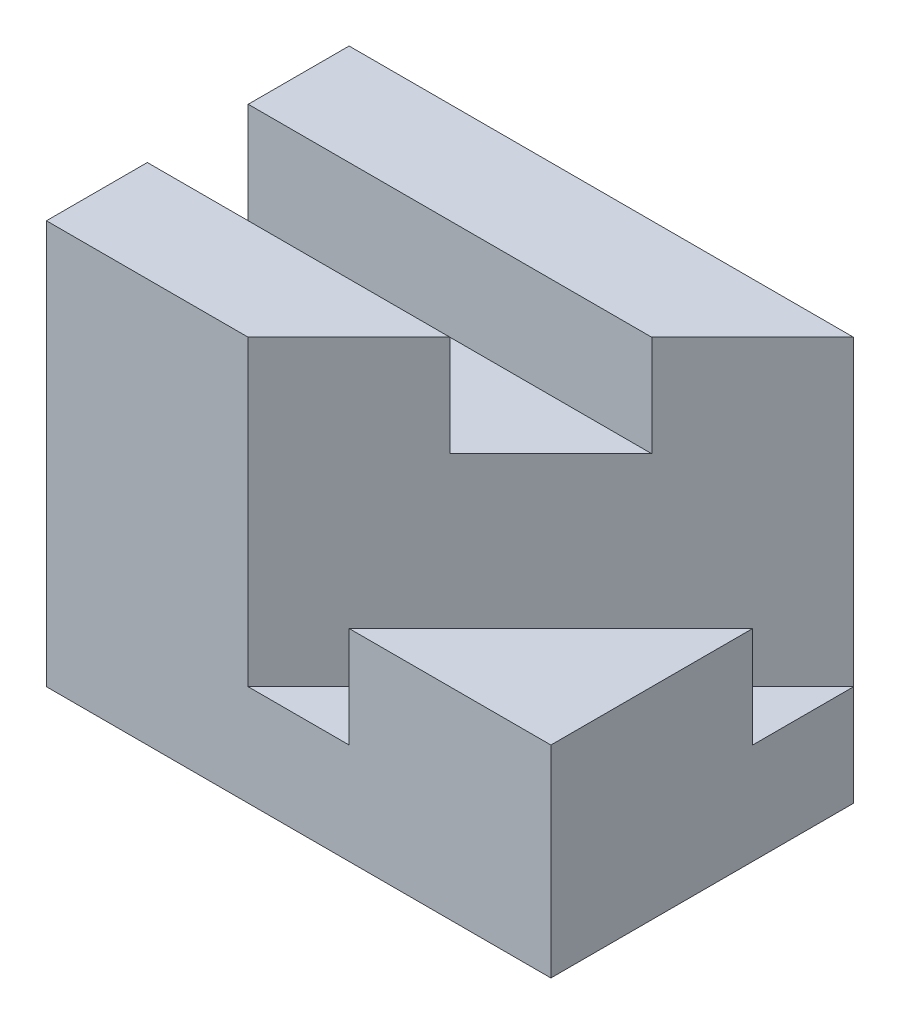
ISO-10303-21;
HEADER;
FILE_DESCRIPTION(('STEP AP214'),'2;1');
FILE_NAME('part.step','',(''),(''),'','','');
FILE_SCHEMA(('AUTOMOTIVE_DESIGN { 1 0 10303 214 1 1 1 1 }'));
ENDSEC;
DATA;
#1=APPLICATION_CONTEXT('core data for automotive mechanical design processes');
#2=APPLICATION_PROTOCOL_DEFINITION('international standard','automotive_design',2000,#1);
#3=PRODUCT_CONTEXT('',#1,'mechanical');
#4=PRODUCT('Part','Part','',(#3));
#5=PRODUCT_RELATED_PRODUCT_CATEGORY('part','',(#4));
#6=PRODUCT_DEFINITION_FORMATION('','',#4);
#7=PRODUCT_DEFINITION_CONTEXT('part definition',#1,'design');
#8=PRODUCT_DEFINITION('design','',#6,#7);
#9=PRODUCT_DEFINITION_SHAPE('','',#8);
#10=(LENGTH_UNIT() NAMED_UNIT(*) SI_UNIT(.MILLI.,.METRE.));
#11=(NAMED_UNIT(*) PLANE_ANGLE_UNIT() SI_UNIT($,.RADIAN.));
#12=(NAMED_UNIT(*) SI_UNIT($,.STERADIAN.) SOLID_ANGLE_UNIT());
#13=UNCERTAINTY_MEASURE_WITH_UNIT(LENGTH_MEASURE(1.E-05),#10,'distance_accuracy_value','');
#14=(GEOMETRIC_REPRESENTATION_CONTEXT(3) GLOBAL_UNCERTAINTY_ASSIGNED_CONTEXT((#13)) GLOBAL_UNIT_ASSIGNED_CONTEXT((#10,
#11,#12)) REPRESENTATION_CONTEXT('',''));
#15=CARTESIAN_POINT('',(0.,0.,0.));
#16=DIRECTION('',(0.,0.,1.));
#17=DIRECTION('',(1.,0.,0.));
#18=AXIS2_PLACEMENT_3D('',#15,#16,#17);
#19=CARTESIAN_POINT('',(50.,10.,0.));
#20=DIRECTION('',(1.,0.,0.));
#21=DIRECTION('',(0.,0.,-1.));
#22=AXIS2_PLACEMENT_3D('',#19,#20,#21);
#23=PLANE('',#22);
#24=DIRECTION('',(0.,0.,1.));
#25=VECTOR('',#24,1.);
#26=CARTESIAN_POINT('',(50.,0.,0.));
#27=LINE('',#26,#25);
#28=CARTESIAN_POINT('',(50.,0.,-30.));
#29=VERTEX_POINT('',#28);
#30=CARTESIAN_POINT('',(50.,0.,0.));
#31=VERTEX_POINT('',#30);
#32=EDGE_CURVE('E203',#29,#31,#27,.T.);
#33=ORIENTED_EDGE('',*,*,#32,.F.);
#34=DIRECTION('',(0.,-1.,0.));
#35=VECTOR('',#34,1.);
#36=CARTESIAN_POINT('',(50.,10.,-30.));
#37=LINE('',#36,#35);
#38=CARTESIAN_POINT('',(50.,10.,-30.));
#39=VERTEX_POINT('',#38);
#40=EDGE_CURVE('E11',#39,#29,#37,.T.);
#41=ORIENTED_EDGE('',*,*,#40,.F.);
#42=DIRECTION('',(0.,0.,1.));
#43=VECTOR('',#42,1.);
#44=CARTESIAN_POINT('',(50.,10.,0.));
#45=LINE('',#44,#43);
#46=CARTESIAN_POINT('',(50.,10.,-20.));
#47=VERTEX_POINT('',#46);
#48=EDGE_CURVE('E206',#39,#47,#45,.T.);
#49=ORIENTED_EDGE('',*,*,#48,.T.);
#50=DIRECTION('',(0.,-1.,0.));
#51=VECTOR('',#50,1.);
#52=CARTESIAN_POINT('',(50.,20.,-20.));
#53=LINE('',#52,#51);
#54=CARTESIAN_POINT('',(50.,20.,-20.));
#55=VERTEX_POINT('',#54);
#56=EDGE_CURVE('E201',#55,#47,#53,.T.);
#57=ORIENTED_EDGE('',*,*,#56,.F.);
#58=DIRECTION('',(0.,0.,1.));
#59=VECTOR('',#58,1.);
#60=CARTESIAN_POINT('',(50.,20.,0.));
#61=LINE('',#60,#59);
#62=CARTESIAN_POINT('',(50.,20.,0.));
#63=VERTEX_POINT('',#62);
#64=EDGE_CURVE('E186',#55,#63,#61,.T.);
#65=ORIENTED_EDGE('',*,*,#64,.T.);
#66=DIRECTION('',(0.,-1.,0.));
#67=VECTOR('',#66,1.);
#68=CARTESIAN_POINT('',(50.,20.,0.));
#69=LINE('',#68,#67);
#70=EDGE_CURVE('E195',#63,#31,#69,.T.);
#71=ORIENTED_EDGE('',*,*,#70,.T.);
#72=EDGE_LOOP('',(#33,#41,#49,#57,#65,#71));
#73=FACE_BOUND('',#72,.T.);
#74=ADVANCED_FACE('F33',(#73),#23,.T.);
#75=CARTESIAN_POINT('',(0.,10.,0.));
#76=DIRECTION('',(0.,0.,1.));
#77=DIRECTION('',(1.,0.,0.));
#78=AXIS2_PLACEMENT_3D('',#75,#76,#77);
#79=PLANE('',#78);
#80=DIRECTION('',(-1.,0.,0.));
#81=VECTOR('',#80,1.);
#82=CARTESIAN_POINT('',(0.,0.,0.));
#83=LINE('',#82,#81);
#84=CARTESIAN_POINT('',(0.,0.,0.));
#85=VERTEX_POINT('',#84);
#86=EDGE_CURVE('E207',#31,#85,#83,.T.);
#87=ORIENTED_EDGE('',*,*,#86,.F.);
#88=ORIENTED_EDGE('',*,*,#70,.F.);
#89=DIRECTION('',(-1.,0.,0.));
#90=VECTOR('',#89,1.);
#91=CARTESIAN_POINT('',(0.,20.,0.));
#92=LINE('',#91,#90);
#93=CARTESIAN_POINT('',(30.,20.,0.));
#94=VERTEX_POINT('',#93);
#95=EDGE_CURVE('E192',#63,#94,#92,.T.);
#96=ORIENTED_EDGE('',*,*,#95,.T.);
#97=DIRECTION('',(0.,-1.,0.));
#98=VECTOR('',#97,1.);
#99=CARTESIAN_POINT('',(30.,20.,0.));
#100=LINE('',#99,#98);
#101=CARTESIAN_POINT('',(30.,10.,0.));
#102=VERTEX_POINT('',#101);
#103=EDGE_CURVE('E198',#94,#102,#100,.T.);
#104=ORIENTED_EDGE('',*,*,#103,.T.);
#105=DIRECTION('',(-1.,0.,0.));
#106=VECTOR('',#105,1.);
#107=CARTESIAN_POINT('',(0.,10.,0.));
#108=LINE('',#107,#106);
#109=CARTESIAN_POINT('',(20.,10.,0.));
#110=VERTEX_POINT('',#109);
#111=EDGE_CURVE('E41',#102,#110,#108,.T.);
#112=ORIENTED_EDGE('',*,*,#111,.T.);
#113=DIRECTION('',(0.,-1.,0.));
#114=VECTOR('',#113,1.);
#115=CARTESIAN_POINT('',(20.,40.,0.));
#116=LINE('',#115,#114);
#117=CARTESIAN_POINT('',(20.,40.,0.));
#118=VERTEX_POINT('',#117);
#119=EDGE_CURVE('E168',#118,#110,#116,.T.);
#120=ORIENTED_EDGE('',*,*,#119,.F.);
#121=DIRECTION('',(-1.,0.,0.));
#122=VECTOR('',#121,1.);
#123=CARTESIAN_POINT('',(0.,40.,0.));
#124=LINE('',#123,#122);
#125=CARTESIAN_POINT('',(0.,40.,0.));
#126=VERTEX_POINT('',#125);
#127=EDGE_CURVE('E160',#118,#126,#124,.T.);
#128=ORIENTED_EDGE('',*,*,#127,.T.);
#129=DIRECTION('',(0.,-1.,0.));
#130=VECTOR('',#129,1.);
#131=CARTESIAN_POINT('',(0.,40.,0.));
#132=LINE('',#131,#130);
#133=EDGE_CURVE('E171',#126,#85,#132,.T.);
#134=ORIENTED_EDGE('',*,*,#133,.T.);
#135=EDGE_LOOP('',(#87,#88,#96,#104,#112,#120,#128,#134));
#136=FACE_BOUND('',#135,.T.);
#137=ADVANCED_FACE('F219',(#136),#79,.T.);
#138=CARTESIAN_POINT('',(0.,10.,0.));
#139=DIRECTION('',(0.,1.,0.));
#140=DIRECTION('',(0.,0.,1.));
#141=AXIS2_PLACEMENT_3D('',#138,#139,#140);
#142=PLANE('',#141);
#143=DIRECTION('',(-0.707106781186548,0.,0.707106781186548));
#144=VECTOR('',#143,1.);
#145=CARTESIAN_POINT('',(15.,10.,15.));
#146=LINE('',#145,#144);
#147=EDGE_CURVE('E204',#47,#102,#146,.T.);
#148=ORIENTED_EDGE('',*,*,#147,.F.);
#149=ORIENTED_EDGE('',*,*,#48,.F.);
#150=DIRECTION('',(-0.707106781186547,0.,0.707106781186548));
#151=VECTOR('',#150,1.);
#152=CARTESIAN_POINT('',(10.,10.,10.));
#153=LINE('',#152,#151);
#154=EDGE_CURVE('E209',#39,#110,#153,.T.);
#155=ORIENTED_EDGE('',*,*,#154,.T.);
#156=ORIENTED_EDGE('',*,*,#111,.F.);
#157=EDGE_LOOP('',(#148,#149,#155,#156));
#158=FACE_BOUND('',#157,.T.);
#159=ADVANCED_FACE('F246',(#158),#142,.T.);
#160=CARTESIAN_POINT('',(0.,0.,0.));
#161=DIRECTION('',(0.,1.,0.));
#162=DIRECTION('',(0.,0.,1.));
#163=AXIS2_PLACEMENT_3D('',#160,#161,#162);
#164=PLANE('',#163);
#165=ORIENTED_EDGE('',*,*,#86,.T.);
#166=DIRECTION('',(0.,0.,-1.));
#167=VECTOR('',#166,1.);
#168=CARTESIAN_POINT('',(0.,0.,0.));
#169=LINE('',#168,#167);
#170=CARTESIAN_POINT('',(0.,0.,-30.));
#171=VERTEX_POINT('',#170);
#172=EDGE_CURVE('E176',#85,#171,#169,.T.);
#173=ORIENTED_EDGE('',*,*,#172,.T.);
#174=DIRECTION('',(1.,0.,0.));
#175=VECTOR('',#174,1.);
#176=CARTESIAN_POINT('',(0.,0.,-30.));
#177=LINE('',#176,#175);
#178=EDGE_CURVE('E142',#171,#29,#177,.T.);
#179=ORIENTED_EDGE('',*,*,#178,.T.);
#180=ORIENTED_EDGE('',*,*,#32,.T.);
#181=EDGE_LOOP('',(#165,#173,#179,#180));
#182=FACE_BOUND('',#181,.T.);
#183=ADVANCED_FACE('F215',(#182),#164,.F.);
#184=CARTESIAN_POINT('',(15.,20.,15.));
#185=DIRECTION('',(0.707106781186548,0.,0.707106781186548));
#186=DIRECTION('',(0.707106781186548,0.,-0.707106781186548));
#187=AXIS2_PLACEMENT_3D('',#184,#185,#186);
#188=PLANE('',#187);
#189=ORIENTED_EDGE('',*,*,#147,.T.);
#190=ORIENTED_EDGE('',*,*,#103,.F.);
#191=DIRECTION('',(-0.707106781186548,0.,0.707106781186548));
#192=VECTOR('',#191,1.);
#193=CARTESIAN_POINT('',(15.,20.,15.));
#194=LINE('',#193,#192);
#195=EDGE_CURVE('E190',#55,#94,#194,.T.);
#196=ORIENTED_EDGE('',*,*,#195,.F.);
#197=ORIENTED_EDGE('',*,*,#56,.T.);
#198=EDGE_LOOP('',(#189,#190,#196,#197));
#199=FACE_BOUND('',#198,.T.);
#200=ADVANCED_FACE('F255',(#199),#188,.F.);
#201=CARTESIAN_POINT('',(0.,20.,0.));
#202=DIRECTION('',(0.,1.,0.));
#203=DIRECTION('',(0.,0.,1.));
#204=AXIS2_PLACEMENT_3D('',#201,#202,#203);
#205=PLANE('',#204);
#206=ORIENTED_EDGE('',*,*,#64,.F.);
#207=ORIENTED_EDGE('',*,*,#195,.T.);
#208=ORIENTED_EDGE('',*,*,#95,.F.);
#209=EDGE_LOOP('',(#206,#207,#208));
#210=FACE_BOUND('',#209,.T.);
#211=ADVANCED_FACE('F252',(#210),#205,.T.);
#212=CARTESIAN_POINT('',(0.,30.,0.));
#213=DIRECTION('',(-1.,0.,0.));
#214=DIRECTION('',(0.,0.,1.));
#215=AXIS2_PLACEMENT_3D('',#212,#213,#214);
#216=PLANE('',#215);
#217=ORIENTED_EDGE('',*,*,#172,.F.);
#218=ORIENTED_EDGE('',*,*,#133,.F.);
#219=DIRECTION('',(0.,0.,-1.));
#220=VECTOR('',#219,1.);
#221=CARTESIAN_POINT('',(0.,40.,0.));
#222=LINE('',#221,#220);
#223=CARTESIAN_POINT('',(0.,40.,-9.99999999999999));
#224=VERTEX_POINT('',#223);
#225=EDGE_CURVE('E157',#126,#224,#222,.T.);
#226=ORIENTED_EDGE('',*,*,#225,.T.);
#227=DIRECTION('',(0.,-1.,0.));
#228=VECTOR('',#227,1.);
#229=CARTESIAN_POINT('',(0.,40.,-9.99999999999999));
#230=LINE('',#229,#228);
#231=CARTESIAN_POINT('',(0.,30.,-9.99999999999999));
#232=VERTEX_POINT('',#231);
#233=EDGE_CURVE('E174',#224,#232,#230,.T.);
#234=ORIENTED_EDGE('',*,*,#233,.T.);
#235=DIRECTION('',(0.,0.,-1.));
#236=VECTOR('',#235,1.);
#237=CARTESIAN_POINT('',(0.,30.,0.));
#238=LINE('',#237,#236);
#239=CARTESIAN_POINT('',(0.,30.,-20.));
#240=VERTEX_POINT('',#239);
#241=EDGE_CURVE('E124',#232,#240,#238,.T.);
#242=ORIENTED_EDGE('',*,*,#241,.T.);
#243=DIRECTION('',(0.,-1.,0.));
#244=VECTOR('',#243,1.);
#245=CARTESIAN_POINT('',(0.,40.,-20.));
#246=LINE('',#245,#244);
#247=CARTESIAN_POINT('',(0.,40.,-20.));
#248=VERTEX_POINT('',#247);
#249=EDGE_CURVE('E114',#248,#240,#246,.T.);
#250=ORIENTED_EDGE('',*,*,#249,.F.);
#251=DIRECTION('',(0.,0.,-1.));
#252=VECTOR('',#251,1.);
#253=CARTESIAN_POINT('',(0.,40.,0.));
#254=LINE('',#253,#252);
#255=CARTESIAN_POINT('',(0.,40.,-30.));
#256=VERTEX_POINT('',#255);
#257=EDGE_CURVE('E120',#248,#256,#254,.T.);
#258=ORIENTED_EDGE('',*,*,#257,.T.);
#259=DIRECTION('',(0.,-1.,0.));
#260=VECTOR('',#259,1.);
#261=CARTESIAN_POINT('',(0.,40.,-30.));
#262=LINE('',#261,#260);
#263=EDGE_CURVE('E148',#256,#171,#262,.T.);
#264=ORIENTED_EDGE('',*,*,#263,.T.);
#265=EDGE_LOOP('',(#217,#218,#226,#234,#242,#250,#258,#264));
#266=FACE_BOUND('',#265,.T.);
#267=ADVANCED_FACE('F117',(#266),#216,.T.);
#268=CARTESIAN_POINT('',(10.,30.,10.));
#269=DIRECTION('',(0.707106781186548,0.,0.707106781186547));
#270=DIRECTION('',(0.707106781186547,0.,-0.707106781186548));
#271=AXIS2_PLACEMENT_3D('',#268,#269,#270);
#272=PLANE('',#271);
#273=DIRECTION('',(-0.707106781186547,0.,0.707106781186548));
#274=VECTOR('',#273,1.);
#275=CARTESIAN_POINT('',(10.,30.,10.));
#276=LINE('',#275,#274);
#277=CARTESIAN_POINT('',(40.,30.,-20.));
#278=VERTEX_POINT('',#277);
#279=CARTESIAN_POINT('',(30.,30.,-9.99999999999999));
#280=VERTEX_POINT('',#279);
#281=EDGE_CURVE('E183',#278,#280,#276,.T.);
#282=ORIENTED_EDGE('',*,*,#281,.T.);
#283=DIRECTION('',(0.,-1.,0.));
#284=VECTOR('',#283,1.);
#285=CARTESIAN_POINT('',(30.,40.,-9.99999999999999));
#286=LINE('',#285,#284);
#287=CARTESIAN_POINT('',(30.,40.,-9.99999999999999));
#288=VERTEX_POINT('',#287);
#289=EDGE_CURVE('E166',#288,#280,#286,.T.);
#290=ORIENTED_EDGE('',*,*,#289,.F.);
#291=DIRECTION('',(-0.707106781186547,0.,0.707106781186548));
#292=VECTOR('',#291,1.);
#293=CARTESIAN_POINT('',(10.,40.,10.));
#294=LINE('',#293,#292);
#295=EDGE_CURVE('E163',#288,#118,#294,.T.);
#296=ORIENTED_EDGE('',*,*,#295,.T.);
#297=ORIENTED_EDGE('',*,*,#119,.T.);
#298=ORIENTED_EDGE('',*,*,#154,.F.);
#299=DIRECTION('',(0.,-1.,0.));
#300=VECTOR('',#299,1.);
#301=CARTESIAN_POINT('',(50.,40.,-30.));
#302=LINE('',#301,#300);
#303=CARTESIAN_POINT('',(50.,40.,-30.));
#304=VERTEX_POINT('',#303);
#305=EDGE_CURVE('E151',#304,#39,#302,.T.);
#306=ORIENTED_EDGE('',*,*,#305,.F.);
#307=DIRECTION('',(-0.707106781186547,0.,0.707106781186548));
#308=VECTOR('',#307,1.);
#309=CARTESIAN_POINT('',(10.,40.,10.));
#310=LINE('',#309,#308);
#311=CARTESIAN_POINT('',(40.,40.,-20.));
#312=VERTEX_POINT('',#311);
#313=EDGE_CURVE('E137',#304,#312,#310,.T.);
#314=ORIENTED_EDGE('',*,*,#313,.T.);
#315=DIRECTION('',(0.,-1.,0.));
#316=VECTOR('',#315,1.);
#317=CARTESIAN_POINT('',(40.,40.,-20.));
#318=LINE('',#317,#316);
#319=EDGE_CURVE('E128',#312,#278,#318,.T.);
#320=ORIENTED_EDGE('',*,*,#319,.T.);
#321=EDGE_LOOP('',(#282,#290,#296,#297,#298,#306,#314,#320));
#322=FACE_BOUND('',#321,.T.);
#323=ADVANCED_FACE('F226',(#322),#272,.T.);
#324=CARTESIAN_POINT('',(0.,30.,0.));
#325=DIRECTION('',(0.,1.,0.));
#326=DIRECTION('',(0.,0.,1.));
#327=AXIS2_PLACEMENT_3D('',#324,#325,#326);
#328=PLANE('',#327);
#329=DIRECTION('',(1.,0.,0.));
#330=VECTOR('',#329,1.);
#331=CARTESIAN_POINT('',(0.,30.,-20.));
#332=LINE('',#331,#330);
#333=EDGE_CURVE('E177',#240,#278,#332,.T.);
#334=ORIENTED_EDGE('',*,*,#333,.F.);
#335=ORIENTED_EDGE('',*,*,#241,.F.);
#336=DIRECTION('',(1.,0.,0.));
#337=VECTOR('',#336,1.);
#338=CARTESIAN_POINT('',(0.,30.,-9.99999999999999));
#339=LINE('',#338,#337);
#340=EDGE_CURVE('E180',#232,#280,#339,.T.);
#341=ORIENTED_EDGE('',*,*,#340,.T.);
#342=ORIENTED_EDGE('',*,*,#281,.F.);
#343=EDGE_LOOP('',(#334,#335,#341,#342));
#344=FACE_BOUND('',#343,.T.);
#345=ADVANCED_FACE('F231',(#344),#328,.T.);
#346=CARTESIAN_POINT('',(0.,40.,-9.99999999999999));
#347=DIRECTION('',(0.,0.,-1.));
#348=DIRECTION('',(-1.,0.,0.));
#349=AXIS2_PLACEMENT_3D('',#346,#347,#348);
#350=PLANE('',#349);
#351=ORIENTED_EDGE('',*,*,#289,.T.);
#352=ORIENTED_EDGE('',*,*,#340,.F.);
#353=ORIENTED_EDGE('',*,*,#233,.F.);
#354=DIRECTION('',(1.,0.,0.));
#355=VECTOR('',#354,1.);
#356=CARTESIAN_POINT('',(0.,40.,-9.99999999999999));
#357=LINE('',#356,#355);
#358=EDGE_CURVE('E127',#224,#288,#357,.T.);
#359=ORIENTED_EDGE('',*,*,#358,.T.);
#360=EDGE_LOOP('',(#351,#352,#353,#359));
#361=FACE_BOUND('',#360,.T.);
#362=ADVANCED_FACE('F229',(#361),#350,.T.);
#363=CARTESIAN_POINT('',(0.,40.,0.));
#364=DIRECTION('',(0.,1.,0.));
#365=DIRECTION('',(0.,0.,1.));
#366=AXIS2_PLACEMENT_3D('',#363,#364,#365);
#367=PLANE('',#366);
#368=ORIENTED_EDGE('',*,*,#358,.F.);
#369=ORIENTED_EDGE('',*,*,#225,.F.);
#370=ORIENTED_EDGE('',*,*,#127,.F.);
#371=ORIENTED_EDGE('',*,*,#295,.F.);
#372=EDGE_LOOP('',(#368,#369,#370,#371));
#373=FACE_BOUND('',#372,.T.);
#374=ADVANCED_FACE('F224',(#373),#367,.T.);
#375=CARTESIAN_POINT('',(0.,40.,-20.));
#376=DIRECTION('',(0.,0.,-1.));
#377=DIRECTION('',(-1.,0.,0.));
#378=AXIS2_PLACEMENT_3D('',#375,#376,#377);
#379=PLANE('',#378);
#380=ORIENTED_EDGE('',*,*,#333,.T.);
#381=ORIENTED_EDGE('',*,*,#319,.F.);
#382=DIRECTION('',(1.,0.,0.));
#383=VECTOR('',#382,1.);
#384=CARTESIAN_POINT('',(0.,40.,-20.));
#385=LINE('',#384,#383);
#386=EDGE_CURVE('E131',#248,#312,#385,.T.);
#387=ORIENTED_EDGE('',*,*,#386,.F.);
#388=ORIENTED_EDGE('',*,*,#249,.T.);
#389=EDGE_LOOP('',(#380,#381,#387,#388));
#390=FACE_BOUND('',#389,.T.);
#391=ADVANCED_FACE('F132',(#390),#379,.F.);
#392=CARTESIAN_POINT('',(0.,40.,-30.));
#393=DIRECTION('',(0.,0.,-1.));
#394=DIRECTION('',(-1.,0.,0.));
#395=AXIS2_PLACEMENT_3D('',#392,#393,#394);
#396=PLANE('',#395);
#397=ORIENTED_EDGE('',*,*,#178,.F.);
#398=ORIENTED_EDGE('',*,*,#263,.F.);
#399=DIRECTION('',(1.,0.,0.));
#400=VECTOR('',#399,1.);
#401=CARTESIAN_POINT('',(0.,40.,-30.));
#402=LINE('',#401,#400);
#403=EDGE_CURVE('E141',#256,#304,#402,.T.);
#404=ORIENTED_EDGE('',*,*,#403,.T.);
#405=ORIENTED_EDGE('',*,*,#305,.T.);
#406=ORIENTED_EDGE('',*,*,#40,.T.);
#407=EDGE_LOOP('',(#397,#398,#404,#405,#406));
#408=FACE_BOUND('',#407,.T.);
#409=ADVANCED_FACE('F233',(#408),#396,.T.);
#410=CARTESIAN_POINT('',(0.,40.,0.));
#411=DIRECTION('',(0.,1.,0.));
#412=DIRECTION('',(0.,0.,1.));
#413=AXIS2_PLACEMENT_3D('',#410,#411,#412);
#414=PLANE('',#413);
#415=ORIENTED_EDGE('',*,*,#257,.F.);
#416=ORIENTED_EDGE('',*,*,#386,.T.);
#417=ORIENTED_EDGE('',*,*,#313,.F.);
#418=ORIENTED_EDGE('',*,*,#403,.F.);
#419=EDGE_LOOP('',(#415,#416,#417,#418));
#420=FACE_BOUND('',#419,.T.);
#421=ADVANCED_FACE('F139',(#420),#414,.T.);
#422=CLOSED_SHELL('',(#74,#137,#159,#183,#200,#211,#267,#323,#345,#362,#374,#391,#409,#421));
#423=MANIFOLD_SOLID_BREP('B2',#422);
#424=ADVANCED_BREP_SHAPE_REPRESENTATION('',(#18,#423),#14);
#425=SHAPE_DEFINITION_REPRESENTATION(#9,#424);
ENDSEC;
END-ISO-10303-21;
